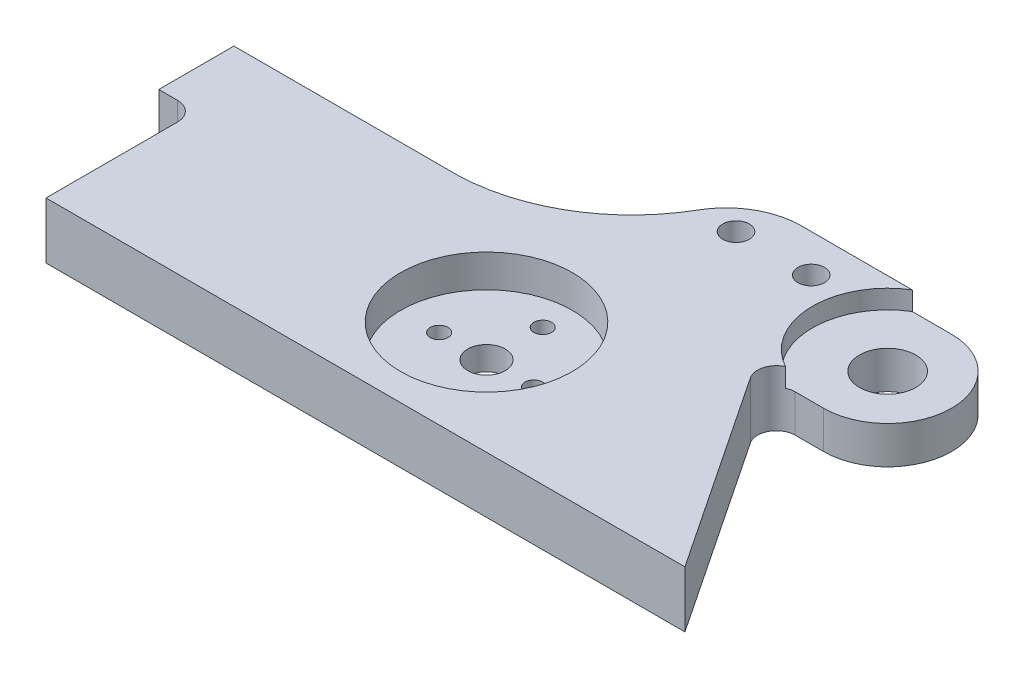
ISO-10303-21;
HEADER;
FILE_DESCRIPTION(('STEP AP214'),'2;1');
FILE_NAME('part.step','',(''),(''),'','','');
FILE_SCHEMA(('AUTOMOTIVE_DESIGN { 1 0 10303 214 1 1 1 1 }'));
ENDSEC;
DATA;
#1=APPLICATION_CONTEXT('core data for automotive mechanical design processes');
#2=APPLICATION_PROTOCOL_DEFINITION('international standard','automotive_design',2000,#1);
#3=PRODUCT_CONTEXT('',#1,'mechanical');
#4=PRODUCT('Part','Part','',(#3));
#5=PRODUCT_RELATED_PRODUCT_CATEGORY('part','',(#4));
#6=PRODUCT_DEFINITION_FORMATION('','',#4);
#7=PRODUCT_DEFINITION_CONTEXT('part definition',#1,'design');
#8=PRODUCT_DEFINITION('design','',#6,#7);
#9=PRODUCT_DEFINITION_SHAPE('','',#8);
#10=(LENGTH_UNIT() NAMED_UNIT(*) SI_UNIT(.MILLI.,.METRE.));
#11=(NAMED_UNIT(*) PLANE_ANGLE_UNIT() SI_UNIT($,.RADIAN.));
#12=(NAMED_UNIT(*) SI_UNIT($,.STERADIAN.) SOLID_ANGLE_UNIT());
#13=UNCERTAINTY_MEASURE_WITH_UNIT(LENGTH_MEASURE(1.E-05),#10,'distance_accuracy_value','');
#14=(GEOMETRIC_REPRESENTATION_CONTEXT(3) GLOBAL_UNCERTAINTY_ASSIGNED_CONTEXT((#13)) GLOBAL_UNIT_ASSIGNED_CONTEXT((#10,
#11,#12)) REPRESENTATION_CONTEXT('',''));
#15=CARTESIAN_POINT('',(0.,0.,0.));
#16=DIRECTION('',(0.,0.,1.));
#17=DIRECTION('',(1.,0.,0.));
#18=AXIS2_PLACEMENT_3D('',#15,#16,#17);
#19=CARTESIAN_POINT('',(99.6289220182295,9.525,0.));
#20=DIRECTION('',(0.,0.,-1.));
#21=DIRECTION('',(-1.,0.,0.));
#22=AXIS2_PLACEMENT_3D('',#19,#20,#21);
#23=PLANE('',#22);
#24=DIRECTION('',(1.,0.,0.));
#25=VECTOR('',#24,1.);
#26=CARTESIAN_POINT('',(99.6289220182295,6.35,0.));
#27=LINE('',#26,#25);
#28=CARTESIAN_POINT('',(94.8325417665327,6.35,0.));
#29=VERTEX_POINT('',#28);
#30=CARTESIAN_POINT('',(99.6289220182295,6.35,0.));
#31=VERTEX_POINT('',#30);
#32=EDGE_CURVE('E294',#29,#31,#27,.T.);
#33=ORIENTED_EDGE('',*,*,#32,.F.);
#34=DIRECTION('',(0.,-1.,0.));
#35=VECTOR('',#34,1.);
#36=CARTESIAN_POINT('',(94.8325417665327,0.,0.));
#37=LINE('',#36,#35);
#38=CARTESIAN_POINT('',(94.8325417665327,0.,0.));
#39=VERTEX_POINT('',#38);
#40=EDGE_CURVE('E262',#29,#39,#37,.T.);
#41=ORIENTED_EDGE('',*,*,#40,.T.);
#42=DIRECTION('',(1.,0.,0.));
#43=VECTOR('',#42,1.);
#44=CARTESIAN_POINT('',(99.6289220182295,0.,0.));
#45=LINE('',#44,#43);
#46=CARTESIAN_POINT('',(99.6289220182295,0.,0.));
#47=VERTEX_POINT('',#46);
#48=EDGE_CURVE('E210',#39,#47,#45,.T.);
#49=ORIENTED_EDGE('',*,*,#48,.T.);
#50=DIRECTION('',(0.,-1.,0.));
#51=VECTOR('',#50,1.);
#52=CARTESIAN_POINT('',(99.6289220182295,9.525,0.));
#53=LINE('',#52,#51);
#54=EDGE_CURVE('E247',#31,#47,#53,.T.);
#55=ORIENTED_EDGE('',*,*,#54,.F.);
#56=EDGE_LOOP('',(#33,#41,#49,#55));
#57=FACE_BOUND('',#56,.T.);
#58=ADVANCED_FACE('F40',(#57),#23,.F.);
#59=CARTESIAN_POINT('',(99.6289220182295,9.525,-10.8159932240115));
#60=DIRECTION('',(0.,-1.,0.));
#61=DIRECTION('',(0.,0.,-1.));
#62=AXIS2_PLACEMENT_3D('',#59,#60,#61);
#63=CYLINDRICAL_SURFACE('',#62,10.8159932240115);
#64=CARTESIAN_POINT('',(99.6289220182295,6.35,-10.8159932240115));
#65=DIRECTION('',(0.,1.,0.));
#66=DIRECTION('',(0.,0.,1.));
#67=AXIS2_PLACEMENT_3D('',#64,#65,#66);
#68=CIRCLE('',#67,10.8159932240115);
#69=CARTESIAN_POINT('',(99.6289220182295,6.35,-21.6319864480231));
#70=VERTEX_POINT('',#69);
#71=EDGE_CURVE('E302',#31,#70,#68,.T.);
#72=ORIENTED_EDGE('',*,*,#71,.F.);
#73=ORIENTED_EDGE('',*,*,#54,.T.);
#74=CARTESIAN_POINT('',(99.6289220182295,0.,-10.8159932240115));
#75=DIRECTION('',(0.,1.,0.));
#76=DIRECTION('',(0.,0.,-1.));
#77=AXIS2_PLACEMENT_3D('',#74,#75,#76);
#78=CIRCLE('',#77,10.8159932240115);
#79=CARTESIAN_POINT('',(99.6289220182295,0.,-21.6319864480231));
#80=VERTEX_POINT('',#79);
#81=EDGE_CURVE('E214',#47,#80,#78,.T.);
#82=ORIENTED_EDGE('',*,*,#81,.T.);
#83=DIRECTION('',(0.,-1.,0.));
#84=VECTOR('',#83,1.);
#85=CARTESIAN_POINT('',(99.6289220182295,9.525,-21.6319864480231));
#86=LINE('',#85,#84);
#87=EDGE_CURVE('E244',#70,#80,#86,.T.);
#88=ORIENTED_EDGE('',*,*,#87,.F.);
#89=EDGE_LOOP('',(#72,#73,#82,#88));
#90=FACE_BOUND('',#89,.T.);
#91=ADVANCED_FACE('F317',(#90),#63,.T.);
#92=CARTESIAN_POINT('',(99.6289220182295,9.525,-10.8159932240115));
#93=DIRECTION('',(0.,-1.,0.));
#94=DIRECTION('',(0.,0.,-1.));
#95=AXIS2_PLACEMENT_3D('',#92,#93,#94);
#96=CYLINDRICAL_SURFACE('',#95,4.76250000000001);
#97=CARTESIAN_POINT('',(99.6289220182295,0.,-10.8159932240115));
#98=DIRECTION('',(0.,1.,0.));
#99=DIRECTION('',(0.,0.,1.));
#100=AXIS2_PLACEMENT_3D('',#97,#98,#99);
#101=CIRCLE('',#100,4.76250000000001);
#102=CARTESIAN_POINT('',(99.6289220182295,0.,-6.05349322401153));
#103=VERTEX_POINT('',#102);
#104=EDGE_CURVE('E197',#103,#103,#101,.T.);
#105=ORIENTED_EDGE('',*,*,#104,.F.);
#106=EDGE_LOOP('',(#105));
#107=FACE_BOUND('',#106,.T.);
#108=CARTESIAN_POINT('',(99.6289220182295,6.35,-10.8159932240115));
#109=DIRECTION('',(0.,1.,0.));
#110=DIRECTION('',(0.,0.,1.));
#111=AXIS2_PLACEMENT_3D('',#108,#109,#110);
#112=CIRCLE('',#111,4.76250000000001);
#113=CARTESIAN_POINT('',(99.6289220182295,6.35,-6.05349322401153));
#114=VERTEX_POINT('',#113);
#115=EDGE_CURVE('E157',#114,#114,#112,.T.);
#116=ORIENTED_EDGE('',*,*,#115,.T.);
#117=EDGE_LOOP('',(#116));
#118=FACE_BOUND('',#117,.T.);
#119=ADVANCED_FACE('F445',(#107,#118),#96,.F.);
#120=CARTESIAN_POINT('',(69.7204790438301,9.525,19.05));
#121=DIRECTION('',(0.,-1.,0.));
#122=DIRECTION('',(0.,0.,-1.));
#123=AXIS2_PLACEMENT_3D('',#120,#121,#122);
#124=CYLINDRICAL_SURFACE('',#123,1.5);
#125=CARTESIAN_POINT('',(69.7204790438301,0.,19.05));
#126=DIRECTION('',(0.,1.,0.));
#127=DIRECTION('',(0.,0.,1.));
#128=AXIS2_PLACEMENT_3D('',#125,#126,#127);
#129=CIRCLE('',#128,1.5);
#130=CARTESIAN_POINT('',(69.7204790438301,0.,20.55));
#131=VERTEX_POINT('',#130);
#132=EDGE_CURVE('E364',#131,#131,#129,.T.);
#133=ORIENTED_EDGE('',*,*,#132,.F.);
#134=EDGE_LOOP('',(#133));
#135=FACE_BOUND('',#134,.T.);
#136=CARTESIAN_POINT('',(69.7204790438301,4.,19.05));
#137=DIRECTION('',(0.,1.,0.));
#138=DIRECTION('',(0.,0.,1.));
#139=AXIS2_PLACEMENT_3D('',#136,#137,#138);
#140=CIRCLE('',#139,1.5);
#141=CARTESIAN_POINT('',(69.7204790438301,4.,20.55));
#142=VERTEX_POINT('',#141);
#143=EDGE_CURVE('E344',#142,#142,#140,.T.);
#144=ORIENTED_EDGE('',*,*,#143,.T.);
#145=EDGE_LOOP('',(#144));
#146=FACE_BOUND('',#145,.T.);
#147=ADVANCED_FACE('F475',(#135,#146),#124,.F.);
#148=CARTESIAN_POINT('',(61.7204790438301,9.525,28.55));
#149=DIRECTION('',(0.,-1.,0.));
#150=DIRECTION('',(0.,0.,-1.));
#151=AXIS2_PLACEMENT_3D('',#148,#149,#150);
#152=CYLINDRICAL_SURFACE('',#151,1.5);
#153=CARTESIAN_POINT('',(61.7204790438301,0.,28.55));
#154=DIRECTION('',(0.,1.,0.));
#155=DIRECTION('',(0.,0.,1.));
#156=AXIS2_PLACEMENT_3D('',#153,#154,#155);
#157=CIRCLE('',#156,1.5);
#158=CARTESIAN_POINT('',(61.7204790438301,0.,30.05));
#159=VERTEX_POINT('',#158);
#160=EDGE_CURVE('E360',#159,#159,#157,.T.);
#161=ORIENTED_EDGE('',*,*,#160,.F.);
#162=EDGE_LOOP('',(#161));
#163=FACE_BOUND('',#162,.T.);
#164=CARTESIAN_POINT('',(61.7204790438301,4.,28.55));
#165=DIRECTION('',(0.,1.,0.));
#166=DIRECTION('',(0.,0.,1.));
#167=AXIS2_PLACEMENT_3D('',#164,#165,#166);
#168=CIRCLE('',#167,1.5);
#169=CARTESIAN_POINT('',(61.7204790438301,4.,30.05));
#170=VERTEX_POINT('',#169);
#171=EDGE_CURVE('E340',#170,#170,#168,.T.);
#172=ORIENTED_EDGE('',*,*,#171,.T.);
#173=EDGE_LOOP('',(#172));
#174=FACE_BOUND('',#173,.T.);
#175=ADVANCED_FACE('F548',(#163,#174),#152,.F.);
#176=CARTESIAN_POINT('',(53.7204790438301,9.525,19.05));
#177=DIRECTION('',(0.,-1.,0.));
#178=DIRECTION('',(0.,0.,-1.));
#179=AXIS2_PLACEMENT_3D('',#176,#177,#178);
#180=CYLINDRICAL_SURFACE('',#179,1.5);
#181=CARTESIAN_POINT('',(53.7204790438301,0.,19.05));
#182=DIRECTION('',(0.,1.,0.));
#183=DIRECTION('',(0.,0.,1.));
#184=AXIS2_PLACEMENT_3D('',#181,#182,#183);
#185=CIRCLE('',#184,1.5);
#186=CARTESIAN_POINT('',(53.7204790438301,0.,20.55));
#187=VERTEX_POINT('',#186);
#188=EDGE_CURVE('E356',#187,#187,#185,.T.);
#189=ORIENTED_EDGE('',*,*,#188,.F.);
#190=EDGE_LOOP('',(#189));
#191=FACE_BOUND('',#190,.T.);
#192=CARTESIAN_POINT('',(53.7204790438301,4.,19.05));
#193=DIRECTION('',(0.,1.,0.));
#194=DIRECTION('',(0.,0.,1.));
#195=AXIS2_PLACEMENT_3D('',#192,#193,#194);
#196=CIRCLE('',#195,1.5);
#197=CARTESIAN_POINT('',(53.7204790438301,4.,20.55));
#198=VERTEX_POINT('',#197);
#199=EDGE_CURVE('E336',#198,#198,#196,.T.);
#200=ORIENTED_EDGE('',*,*,#199,.T.);
#201=EDGE_LOOP('',(#200));
#202=FACE_BOUND('',#201,.T.);
#203=ADVANCED_FACE('F558',(#191,#202),#180,.F.);
#204=CARTESIAN_POINT('',(61.7204790438301,9.525,9.55000000000001));
#205=DIRECTION('',(0.,-1.,0.));
#206=DIRECTION('',(0.,0.,-1.));
#207=AXIS2_PLACEMENT_3D('',#204,#205,#206);
#208=CYLINDRICAL_SURFACE('',#207,1.5);
#209=CARTESIAN_POINT('',(61.7204790438301,0.,9.55000000000001));
#210=DIRECTION('',(0.,1.,0.));
#211=DIRECTION('',(0.,0.,1.));
#212=AXIS2_PLACEMENT_3D('',#209,#210,#211);
#213=CIRCLE('',#212,1.5);
#214=CARTESIAN_POINT('',(61.7204790438301,0.,11.05));
#215=VERTEX_POINT('',#214);
#216=EDGE_CURVE('E352',#215,#215,#213,.T.);
#217=ORIENTED_EDGE('',*,*,#216,.F.);
#218=EDGE_LOOP('',(#217));
#219=FACE_BOUND('',#218,.T.);
#220=CARTESIAN_POINT('',(61.7204790438301,4.,9.55000000000001));
#221=DIRECTION('',(0.,1.,0.));
#222=DIRECTION('',(0.,0.,1.));
#223=AXIS2_PLACEMENT_3D('',#220,#221,#222);
#224=CIRCLE('',#223,1.5);
#225=CARTESIAN_POINT('',(61.7204790438301,4.,11.05));
#226=VERTEX_POINT('',#225);
#227=EDGE_CURVE('E288',#226,#226,#224,.T.);
#228=ORIENTED_EDGE('',*,*,#227,.T.);
#229=EDGE_LOOP('',(#228));
#230=FACE_BOUND('',#229,.T.);
#231=ADVANCED_FACE('F567',(#219,#230),#208,.F.);
#232=CARTESIAN_POINT('',(61.7204790438301,9.525,19.05));
#233=DIRECTION('',(0.,-1.,0.));
#234=DIRECTION('',(0.,0.,-1.));
#235=AXIS2_PLACEMENT_3D('',#232,#233,#234);
#236=CYLINDRICAL_SURFACE('',#235,3.175);
#237=CARTESIAN_POINT('',(61.7204790438301,0.,19.05));
#238=DIRECTION('',(0.,1.,0.));
#239=DIRECTION('',(0.,0.,1.));
#240=AXIS2_PLACEMENT_3D('',#237,#238,#239);
#241=CIRCLE('',#240,3.175);
#242=CARTESIAN_POINT('',(61.7204790438301,0.,22.225));
#243=VERTEX_POINT('',#242);
#244=EDGE_CURVE('E348',#243,#243,#241,.T.);
#245=ORIENTED_EDGE('',*,*,#244,.F.);
#246=EDGE_LOOP('',(#245));
#247=FACE_BOUND('',#246,.T.);
#248=CARTESIAN_POINT('',(61.7204790438301,4.,19.05));
#249=DIRECTION('',(0.,1.,0.));
#250=DIRECTION('',(0.,0.,1.));
#251=AXIS2_PLACEMENT_3D('',#248,#249,#250);
#252=CIRCLE('',#251,3.175);
#253=CARTESIAN_POINT('',(61.7204790438301,4.,22.225));
#254=VERTEX_POINT('',#253);
#255=EDGE_CURVE('E285',#254,#254,#252,.T.);
#256=ORIENTED_EDGE('',*,*,#255,.T.);
#257=EDGE_LOOP('',(#256));
#258=FACE_BOUND('',#257,.T.);
#259=ADVANCED_FACE('F483',(#247,#258),#236,.F.);
#260=CARTESIAN_POINT('',(36.7936206027921,9.525,-30.4519912792341));
#261=DIRECTION('',(0.,-1.,0.));
#262=DIRECTION('',(0.,0.,-1.));
#263=AXIS2_PLACEMENT_3D('',#260,#261,#262);
#264=PLANE('',#263);
#265=CARTESIAN_POINT('',(61.7204790438301,9.525,19.05));
#266=DIRECTION('',(0.,1.,0.));
#267=DIRECTION('',(0.,0.,1.));
#268=AXIS2_PLACEMENT_3D('',#265,#266,#267);
#269=CIRCLE('',#268,14.5);
#270=CARTESIAN_POINT('',(61.7204790438301,9.525,33.55));
#271=VERTEX_POINT('',#270);
#272=EDGE_CURVE('E156',#271,#271,#269,.T.);
#273=ORIENTED_EDGE('',*,*,#272,.F.);
#274=EDGE_LOOP('',(#273));
#275=FACE_BOUND('',#274,.T.);
#276=CARTESIAN_POINT('',(94.8325417665327,9.525,3.175));
#277=DIRECTION('',(0.,-1.,0.));
#278=DIRECTION('',(0.,0.,-1.));
#279=AXIS2_PLACEMENT_3D('',#276,#277,#278);
#280=CIRCLE('',#279,3.175);
#281=CARTESIAN_POINT('',(92.1907820820101,9.525,4.9361731230151));
#282=VERTEX_POINT('',#281);
#283=CARTESIAN_POINT('',(93.486164763583,9.525,0.299605424306388));
#284=VERTEX_POINT('',#283);
#285=EDGE_CURVE('E167',#282,#284,#280,.T.);
#286=ORIENTED_EDGE('',*,*,#285,.T.);
#287=CARTESIAN_POINT('',(99.6289220182295,9.525,-10.8159932240115));
#288=DIRECTION('',(0.,1.,0.));
#289=DIRECTION('',(0.,0.,1.));
#290=AXIS2_PLACEMENT_3D('',#287,#288,#289);
#291=CIRCLE('',#290,12.7);
#292=CARTESIAN_POINT('',(92.9727751915635,9.525,-21.6319864480231));
#293=VERTEX_POINT('',#292);
#294=EDGE_CURVE('E151',#293,#284,#291,.T.);
#295=ORIENTED_EDGE('',*,*,#294,.F.);
#296=DIRECTION('',(-1.,0.,0.));
#297=VECTOR('',#296,1.);
#298=CARTESIAN_POINT('',(99.6289220182295,9.525,-21.6319864480231));
#299=LINE('',#298,#297);
#300=CARTESIAN_POINT('',(74.2289220182296,9.525,-21.6319864480231));
#301=VERTEX_POINT('',#300);
#302=EDGE_CURVE('E163',#293,#301,#299,.T.);
#303=ORIENTED_EDGE('',*,*,#302,.T.);
#304=CARTESIAN_POINT('',(74.2289220182296,9.525,-8.93198644802308));
#305=DIRECTION('',(0.,1.,0.));
#306=DIRECTION('',(0.,0.,1.));
#307=AXIS2_PLACEMENT_3D('',#304,#305,#306);
#308=CIRCLE('',#307,12.7);
#309=CARTESIAN_POINT('',(63.2185392489832,9.525,-15.2613996336734));
#310=VERTEX_POINT('',#309);
#311=EDGE_CURVE('E175',#301,#310,#308,.T.);
#312=ORIENTED_EDGE('',*,*,#311,.T.);
#313=CARTESIAN_POINT('',(36.7936206027921,9.525,-30.4519912792341));
#314=DIRECTION('',(0.,-1.,0.));
#315=DIRECTION('',(0.,0.,-1.));
#316=AXIS2_PLACEMENT_3D('',#313,#314,#315);
#317=CIRCLE('',#316,30.48);
#318=CARTESIAN_POINT('',(38.1,9.525,0.));
#319=VERTEX_POINT('',#318);
#320=EDGE_CURVE('E180',#310,#319,#317,.T.);
#321=ORIENTED_EDGE('',*,*,#320,.T.);
#322=DIRECTION('',(-1.,0.,0.));
#323=VECTOR('',#322,1.);
#324=CARTESIAN_POINT('',(0.,9.525,0.));
#325=LINE('',#324,#323);
#326=CARTESIAN_POINT('',(0.,9.525,0.));
#327=VERTEX_POINT('',#326);
#328=EDGE_CURVE('E188',#319,#327,#325,.T.);
#329=ORIENTED_EDGE('',*,*,#328,.T.);
#330=DIRECTION('',(0.,0.,1.));
#331=VECTOR('',#330,1.);
#332=CARTESIAN_POINT('',(0.,9.525,12.7));
#333=LINE('',#332,#331);
#334=CARTESIAN_POINT('',(0.,9.525,12.7));
#335=VERTEX_POINT('',#334);
#336=EDGE_CURVE('E230',#327,#335,#333,.T.);
#337=ORIENTED_EDGE('',*,*,#336,.T.);
#338=DIRECTION('',(1.,0.,0.));
#339=VECTOR('',#338,1.);
#340=CARTESIAN_POINT('',(6.35,9.525,12.7));
#341=LINE('',#340,#339);
#342=CARTESIAN_POINT('',(3.175,9.525,12.7));
#343=VERTEX_POINT('',#342);
#344=EDGE_CURVE('E390',#335,#343,#341,.T.);
#345=ORIENTED_EDGE('',*,*,#344,.T.);
#346=CARTESIAN_POINT('',(3.175,9.525,15.875));
#347=DIRECTION('',(0.,-1.,0.));
#348=DIRECTION('',(0.,0.,-1.));
#349=AXIS2_PLACEMENT_3D('',#346,#347,#348);
#350=CIRCLE('',#349,3.175);
#351=CARTESIAN_POINT('',(6.35,9.525,15.875));
#352=VERTEX_POINT('',#351);
#353=EDGE_CURVE('E282',#343,#352,#350,.T.);
#354=ORIENTED_EDGE('',*,*,#353,.T.);
#355=DIRECTION('',(0.,0.,1.));
#356=VECTOR('',#355,1.);
#357=CARTESIAN_POINT('',(6.35,9.525,38.1));
#358=LINE('',#357,#356);
#359=CARTESIAN_POINT('',(6.35,9.525,38.1));
#360=VERTEX_POINT('',#359);
#361=EDGE_CURVE('E393',#352,#360,#358,.T.);
#362=ORIENTED_EDGE('',*,*,#361,.T.);
#363=DIRECTION('',(1.,0.,0.));
#364=VECTOR('',#363,1.);
#365=CARTESIAN_POINT('',(114.3,9.525,38.1));
#366=LINE('',#365,#364);
#367=CARTESIAN_POINT('',(114.3,9.525,38.1));
#368=VERTEX_POINT('',#367);
#369=EDGE_CURVE('E182',#360,#368,#366,.T.);
#370=ORIENTED_EDGE('',*,*,#369,.T.);
#371=DIRECTION('',(-0.554700196225229,0.,-0.832050294337844));
#372=VECTOR('',#371,1.);
#373=CARTESIAN_POINT('',(88.9,9.525,0.));
#374=LINE('',#373,#372);
#375=EDGE_CURVE('E176',#368,#282,#374,.T.);
#376=ORIENTED_EDGE('',*,*,#375,.T.);
#377=EDGE_LOOP('',(#286,#295,#303,#312,#321,#329,#337,#345,#354,#362,#370,#376));
#378=FACE_BOUND('',#377,.T.);
#379=CARTESIAN_POINT('',(69.5685392489832,9.525,-15.2613996336734));
#380=DIRECTION('',(0.,1.,0.));
#381=DIRECTION('',(0.,0.,1.));
#382=AXIS2_PLACEMENT_3D('',#379,#380,#381);
#383=CIRCLE('',#382,2.2479);
#384=CARTESIAN_POINT('',(69.5685392489832,9.525,-13.0134996336734));
#385=VERTEX_POINT('',#384);
#386=EDGE_CURVE('E377',#385,#385,#383,.T.);
#387=ORIENTED_EDGE('',*,*,#386,.F.);
#388=EDGE_LOOP('',(#387));
#389=FACE_BOUND('',#388,.T.);
#390=CARTESIAN_POINT('',(82.2685392489832,9.525,-15.2613996336734));
#391=DIRECTION('',(0.,1.,0.));
#392=DIRECTION('',(0.,0.,1.));
#393=AXIS2_PLACEMENT_3D('',#390,#391,#392);
#394=CIRCLE('',#393,2.2479);
#395=CARTESIAN_POINT('',(82.2685392489832,9.525,-13.0134996336734));
#396=VERTEX_POINT('',#395);
#397=EDGE_CURVE('E369',#396,#396,#394,.T.);
#398=ORIENTED_EDGE('',*,*,#397,.F.);
#399=EDGE_LOOP('',(#398));
#400=FACE_BOUND('',#399,.T.);
#401=ADVANCED_FACE('F161',(#275,#378,#389,#400),#264,.F.);
#402=CARTESIAN_POINT('',(36.7936206027921,0.,-30.4519912792341));
#403=DIRECTION('',(0.,-1.,0.));
#404=DIRECTION('',(0.,0.,-1.));
#405=AXIS2_PLACEMENT_3D('',#402,#403,#404);
#406=PLANE('',#405);
#407=ORIENTED_EDGE('',*,*,#216,.T.);
#408=EDGE_LOOP('',(#407));
#409=FACE_BOUND('',#408,.T.);
#410=ORIENTED_EDGE('',*,*,#160,.T.);
#411=EDGE_LOOP('',(#410));
#412=FACE_BOUND('',#411,.T.);
#413=CARTESIAN_POINT('',(82.2685392489832,0.,-15.2613996336734));
#414=DIRECTION('',(0.,1.,0.));
#415=DIRECTION('',(0.,0.,1.));
#416=AXIS2_PLACEMENT_3D('',#413,#414,#415);
#417=CIRCLE('',#416,2.2479);
#418=CARTESIAN_POINT('',(82.2685392489832,0.,-13.0134996336734));
#419=VERTEX_POINT('',#418);
#420=EDGE_CURVE('E368',#419,#419,#417,.T.);
#421=ORIENTED_EDGE('',*,*,#420,.T.);
#422=EDGE_LOOP('',(#421));
#423=FACE_BOUND('',#422,.T.);
#424=ORIENTED_EDGE('',*,*,#104,.T.);
#425=EDGE_LOOP('',(#424));
#426=FACE_BOUND('',#425,.T.);
#427=DIRECTION('',(0.,0.,1.));
#428=VECTOR('',#427,1.);
#429=CARTESIAN_POINT('',(0.,0.,12.7));
#430=LINE('',#429,#428);
#431=CARTESIAN_POINT('',(0.,0.,0.));
#432=VERTEX_POINT('',#431);
#433=CARTESIAN_POINT('',(0.,0.,12.7));
#434=VERTEX_POINT('',#433);
#435=EDGE_CURVE('E192',#432,#434,#430,.T.);
#436=ORIENTED_EDGE('',*,*,#435,.F.);
#437=DIRECTION('',(-1.,0.,0.));
#438=VECTOR('',#437,1.);
#439=CARTESIAN_POINT('',(0.,0.,0.));
#440=LINE('',#439,#438);
#441=CARTESIAN_POINT('',(38.1,0.,0.));
#442=VERTEX_POINT('',#441);
#443=EDGE_CURVE('E227',#442,#432,#440,.T.);
#444=ORIENTED_EDGE('',*,*,#443,.F.);
#445=CARTESIAN_POINT('',(36.7936206027921,0.,-30.4519912792341));
#446=DIRECTION('',(0.,-1.,0.));
#447=DIRECTION('',(0.,0.,-1.));
#448=AXIS2_PLACEMENT_3D('',#445,#446,#447);
#449=CIRCLE('',#448,30.48);
#450=CARTESIAN_POINT('',(63.2185392489832,0.,-15.2613996336734));
#451=VERTEX_POINT('',#450);
#452=EDGE_CURVE('E224',#451,#442,#449,.T.);
#453=ORIENTED_EDGE('',*,*,#452,.F.);
#454=CARTESIAN_POINT('',(74.2289220182296,0.,-8.93198644802308));
#455=DIRECTION('',(0.,1.,0.));
#456=DIRECTION('',(0.,0.,1.));
#457=AXIS2_PLACEMENT_3D('',#454,#455,#456);
#458=CIRCLE('',#457,12.7);
#459=CARTESIAN_POINT('',(74.2289220182296,0.,-21.6319864480231));
#460=VERTEX_POINT('',#459);
#461=EDGE_CURVE('E221',#460,#451,#458,.T.);
#462=ORIENTED_EDGE('',*,*,#461,.F.);
#463=DIRECTION('',(-1.,0.,0.));
#464=VECTOR('',#463,1.);
#465=CARTESIAN_POINT('',(99.6289220182295,0.,-21.6319864480231));
#466=LINE('',#465,#464);
#467=EDGE_CURVE('E218',#80,#460,#466,.T.);
#468=ORIENTED_EDGE('',*,*,#467,.F.);
#469=ORIENTED_EDGE('',*,*,#81,.F.);
#470=ORIENTED_EDGE('',*,*,#48,.F.);
#471=CARTESIAN_POINT('',(94.8325417665327,0.,3.175));
#472=DIRECTION('',(0.,-1.,0.));
#473=DIRECTION('',(0.,0.,-1.));
#474=AXIS2_PLACEMENT_3D('',#471,#472,#473);
#475=CIRCLE('',#474,3.175);
#476=CARTESIAN_POINT('',(92.1907820820101,0.,4.9361731230151));
#477=VERTEX_POINT('',#476);
#478=EDGE_CURVE('E268',#39,#477,#475,.F.);
#479=ORIENTED_EDGE('',*,*,#478,.T.);
#480=DIRECTION('',(-0.554700196225229,0.,-0.832050294337844));
#481=VECTOR('',#480,1.);
#482=CARTESIAN_POINT('',(88.9,0.,0.));
#483=LINE('',#482,#481);
#484=CARTESIAN_POINT('',(114.3,0.,38.1));
#485=VERTEX_POINT('',#484);
#486=EDGE_CURVE('E206',#485,#477,#483,.T.);
#487=ORIENTED_EDGE('',*,*,#486,.F.);
#488=DIRECTION('',(1.,0.,0.));
#489=VECTOR('',#488,1.);
#490=CARTESIAN_POINT('',(114.3,0.,38.1));
#491=LINE('',#490,#489);
#492=CARTESIAN_POINT('',(6.35,0.,38.1));
#493=VERTEX_POINT('',#492);
#494=EDGE_CURVE('E203',#493,#485,#491,.T.);
#495=ORIENTED_EDGE('',*,*,#494,.F.);
#496=DIRECTION('',(0.,0.,1.));
#497=VECTOR('',#496,1.);
#498=CARTESIAN_POINT('',(6.35,0.,38.1));
#499=LINE('',#498,#497);
#500=CARTESIAN_POINT('',(6.35,0.,15.875));
#501=VERTEX_POINT('',#500);
#502=EDGE_CURVE('E200',#501,#493,#499,.T.);
#503=ORIENTED_EDGE('',*,*,#502,.F.);
#504=CARTESIAN_POINT('',(3.175,0.,15.875));
#505=DIRECTION('',(0.,-1.,0.));
#506=DIRECTION('',(0.,0.,-1.));
#507=AXIS2_PLACEMENT_3D('',#504,#505,#506);
#508=CIRCLE('',#507,3.175);
#509=CARTESIAN_POINT('',(3.175,0.,12.7));
#510=VERTEX_POINT('',#509);
#511=EDGE_CURVE('E279',#501,#510,#508,.F.);
#512=ORIENTED_EDGE('',*,*,#511,.T.);
#513=DIRECTION('',(1.,0.,0.));
#514=VECTOR('',#513,1.);
#515=CARTESIAN_POINT('',(6.35,0.,12.7));
#516=LINE('',#515,#514);
#517=EDGE_CURVE('E196',#434,#510,#516,.T.);
#518=ORIENTED_EDGE('',*,*,#517,.F.);
#519=EDGE_LOOP('',(#436,#444,#453,#462,#468,#469,#470,#479,#487,#495,#503,#512,#518));
#520=FACE_BOUND('',#519,.T.);
#521=CARTESIAN_POINT('',(69.5685392489832,0.,-15.2613996336734));
#522=DIRECTION('',(0.,1.,0.));
#523=DIRECTION('',(0.,0.,1.));
#524=AXIS2_PLACEMENT_3D('',#521,#522,#523);
#525=CIRCLE('',#524,2.2479);
#526=CARTESIAN_POINT('',(69.5685392489832,0.,-13.0134996336734));
#527=VERTEX_POINT('',#526);
#528=EDGE_CURVE('E373',#527,#527,#525,.T.);
#529=ORIENTED_EDGE('',*,*,#528,.T.);
#530=EDGE_LOOP('',(#529));
#531=FACE_BOUND('',#530,.T.);
#532=ORIENTED_EDGE('',*,*,#132,.T.);
#533=EDGE_LOOP('',(#532));
#534=FACE_BOUND('',#533,.T.);
#535=ORIENTED_EDGE('',*,*,#188,.T.);
#536=EDGE_LOOP('',(#535));
#537=FACE_BOUND('',#536,.T.);
#538=ORIENTED_EDGE('',*,*,#244,.T.);
#539=EDGE_LOOP('',(#538));
#540=FACE_BOUND('',#539,.T.);
#541=ADVANCED_FACE('F311',(#409,#412,#423,#426,#520,#531,#534,#537,#540),#406,.T.);
#542=CARTESIAN_POINT('',(0.,9.525,12.7));
#543=DIRECTION('',(1.,0.,0.));
#544=DIRECTION('',(0.,0.,-1.));
#545=AXIS2_PLACEMENT_3D('',#542,#543,#544);
#546=PLANE('',#545);
#547=ORIENTED_EDGE('',*,*,#435,.T.);
#548=DIRECTION('',(0.,-1.,0.));
#549=VECTOR('',#548,1.);
#550=CARTESIAN_POINT('',(0.,9.525,12.7));
#551=LINE('',#550,#549);
#552=EDGE_CURVE('E258',#335,#434,#551,.T.);
#553=ORIENTED_EDGE('',*,*,#552,.F.);
#554=ORIENTED_EDGE('',*,*,#336,.F.);
#555=DIRECTION('',(0.,-1.,0.));
#556=VECTOR('',#555,1.);
#557=CARTESIAN_POINT('',(0.,9.525,0.));
#558=LINE('',#557,#556);
#559=EDGE_CURVE('E191',#327,#432,#558,.T.);
#560=ORIENTED_EDGE('',*,*,#559,.T.);
#561=EDGE_LOOP('',(#547,#553,#554,#560));
#562=FACE_BOUND('',#561,.T.);
#563=ADVANCED_FACE('F416',(#562),#546,.F.);
#564=CARTESIAN_POINT('',(6.35,9.525,12.7));
#565=DIRECTION('',(0.,0.,-1.));
#566=DIRECTION('',(-1.,0.,0.));
#567=AXIS2_PLACEMENT_3D('',#564,#565,#566);
#568=PLANE('',#567);
#569=ORIENTED_EDGE('',*,*,#517,.T.);
#570=DIRECTION('',(0.,-1.,0.));
#571=VECTOR('',#570,1.);
#572=CARTESIAN_POINT('',(3.175,9.525,12.7));
#573=LINE('',#572,#571);
#574=EDGE_CURVE('E64',#510,#343,#573,.F.);
#575=ORIENTED_EDGE('',*,*,#574,.T.);
#576=ORIENTED_EDGE('',*,*,#344,.F.);
#577=ORIENTED_EDGE('',*,*,#552,.T.);
#578=EDGE_LOOP('',(#569,#575,#576,#577));
#579=FACE_BOUND('',#578,.T.);
#580=ADVANCED_FACE('F414',(#579),#568,.F.);
#581=CARTESIAN_POINT('',(6.35,9.525,38.1));
#582=DIRECTION('',(1.,0.,0.));
#583=DIRECTION('',(0.,0.,-1.));
#584=AXIS2_PLACEMENT_3D('',#581,#582,#583);
#585=PLANE('',#584);
#586=ORIENTED_EDGE('',*,*,#361,.F.);
#587=DIRECTION('',(0.,-1.,0.));
#588=VECTOR('',#587,1.);
#589=CARTESIAN_POINT('',(6.35,0.,15.875));
#590=LINE('',#589,#588);
#591=EDGE_CURVE('E273',#352,#501,#590,.T.);
#592=ORIENTED_EDGE('',*,*,#591,.T.);
#593=ORIENTED_EDGE('',*,*,#502,.T.);
#594=DIRECTION('',(0.,-1.,0.));
#595=VECTOR('',#594,1.);
#596=CARTESIAN_POINT('',(6.35,9.525,38.1));
#597=LINE('',#596,#595);
#598=EDGE_CURVE('E254',#360,#493,#597,.T.);
#599=ORIENTED_EDGE('',*,*,#598,.F.);
#600=EDGE_LOOP('',(#586,#592,#593,#599));
#601=FACE_BOUND('',#600,.T.);
#602=ADVANCED_FACE('F408',(#601),#585,.F.);
#603=CARTESIAN_POINT('',(114.3,9.525,38.1));
#604=DIRECTION('',(0.,0.,-1.));
#605=DIRECTION('',(-1.,0.,0.));
#606=AXIS2_PLACEMENT_3D('',#603,#604,#605);
#607=PLANE('',#606);
#608=ORIENTED_EDGE('',*,*,#494,.T.);
#609=DIRECTION('',(0.,-1.,0.));
#610=VECTOR('',#609,1.);
#611=CARTESIAN_POINT('',(114.3,9.525,38.1));
#612=LINE('',#611,#610);
#613=EDGE_CURVE('E250',#368,#485,#612,.T.);
#614=ORIENTED_EDGE('',*,*,#613,.F.);
#615=ORIENTED_EDGE('',*,*,#369,.F.);
#616=ORIENTED_EDGE('',*,*,#598,.T.);
#617=EDGE_LOOP('',(#608,#614,#615,#616));
#618=FACE_BOUND('',#617,.T.);
#619=ADVANCED_FACE('F402',(#618),#607,.F.);
#620=CARTESIAN_POINT('',(88.9,9.525,0.));
#621=DIRECTION('',(-0.832050294337844,0.,0.554700196225229));
#622=DIRECTION('',(0.554700196225229,0.,0.832050294337844));
#623=AXIS2_PLACEMENT_3D('',#620,#621,#622);
#624=PLANE('',#623);
#625=ORIENTED_EDGE('',*,*,#486,.T.);
#626=DIRECTION('',(0.,-1.,0.));
#627=VECTOR('',#626,1.);
#628=CARTESIAN_POINT('',(92.1907820820101,9.525,4.9361731230151));
#629=LINE('',#628,#627);
#630=EDGE_CURVE('E265',#477,#282,#629,.F.);
#631=ORIENTED_EDGE('',*,*,#630,.T.);
#632=ORIENTED_EDGE('',*,*,#375,.F.);
#633=ORIENTED_EDGE('',*,*,#613,.T.);
#634=EDGE_LOOP('',(#625,#631,#632,#633));
#635=FACE_BOUND('',#634,.T.);
#636=ADVANCED_FACE('F405',(#635),#624,.F.);
#637=CARTESIAN_POINT('',(99.6289220182295,9.525,-21.6319864480231));
#638=DIRECTION('',(0.,0.,1.));
#639=DIRECTION('',(1.,0.,0.));
#640=AXIS2_PLACEMENT_3D('',#637,#638,#639);
#641=PLANE('',#640);
#642=ORIENTED_EDGE('',*,*,#302,.F.);
#643=DIRECTION('',(0.,1.,0.));
#644=VECTOR('',#643,1.);
#645=CARTESIAN_POINT('',(92.9727751915635,6.35,-21.6319864480231));
#646=LINE('',#645,#644);
#647=CARTESIAN_POINT('',(92.9727751915635,6.35,-21.6319864480231));
#648=VERTEX_POINT('',#647);
#649=EDGE_CURVE('E148',#293,#648,#646,.F.);
#650=ORIENTED_EDGE('',*,*,#649,.T.);
#651=DIRECTION('',(-1.,0.,0.));
#652=VECTOR('',#651,1.);
#653=CARTESIAN_POINT('',(99.6289220182295,6.35,-21.6319864480231));
#654=LINE('',#653,#652);
#655=EDGE_CURVE('E319',#70,#648,#654,.T.);
#656=ORIENTED_EDGE('',*,*,#655,.F.);
#657=ORIENTED_EDGE('',*,*,#87,.T.);
#658=ORIENTED_EDGE('',*,*,#467,.T.);
#659=DIRECTION('',(0.,-1.,0.));
#660=VECTOR('',#659,1.);
#661=CARTESIAN_POINT('',(74.2289220182296,9.525,-21.6319864480231));
#662=LINE('',#661,#660);
#663=EDGE_CURVE('E172',#301,#460,#662,.T.);
#664=ORIENTED_EDGE('',*,*,#663,.F.);
#665=EDGE_LOOP('',(#642,#650,#656,#657,#658,#664));
#666=FACE_BOUND('',#665,.T.);
#667=ADVANCED_FACE('F170',(#666),#641,.F.);
#668=CARTESIAN_POINT('',(74.2289220182296,9.525,-8.93198644802308));
#669=DIRECTION('',(0.,-1.,0.));
#670=DIRECTION('',(0.,0.,-1.));
#671=AXIS2_PLACEMENT_3D('',#668,#669,#670);
#672=CYLINDRICAL_SURFACE('',#671,12.7);
#673=ORIENTED_EDGE('',*,*,#461,.T.);
#674=DIRECTION('',(0.,-1.,0.));
#675=VECTOR('',#674,1.);
#676=CARTESIAN_POINT('',(63.2185392489832,9.525,-15.2613996336734));
#677=LINE('',#676,#675);
#678=EDGE_CURVE('E238',#310,#451,#677,.T.);
#679=ORIENTED_EDGE('',*,*,#678,.F.);
#680=ORIENTED_EDGE('',*,*,#311,.F.);
#681=ORIENTED_EDGE('',*,*,#663,.T.);
#682=EDGE_LOOP('',(#673,#679,#680,#681));
#683=FACE_BOUND('',#682,.T.);
#684=ADVANCED_FACE('F429',(#683),#672,.T.);
#685=CARTESIAN_POINT('',(36.7936206027921,9.525,-30.4519912792341));
#686=DIRECTION('',(0.,-1.,0.));
#687=DIRECTION('',(0.,0.,-1.));
#688=AXIS2_PLACEMENT_3D('',#685,#686,#687);
#689=CYLINDRICAL_SURFACE('',#688,30.48);
#690=ORIENTED_EDGE('',*,*,#452,.T.);
#691=DIRECTION('',(0.,-1.,0.));
#692=VECTOR('',#691,1.);
#693=CARTESIAN_POINT('',(38.1,9.525,0.));
#694=LINE('',#693,#692);
#695=EDGE_CURVE('E234',#319,#442,#694,.T.);
#696=ORIENTED_EDGE('',*,*,#695,.F.);
#697=ORIENTED_EDGE('',*,*,#320,.F.);
#698=ORIENTED_EDGE('',*,*,#678,.T.);
#699=EDGE_LOOP('',(#690,#696,#697,#698));
#700=FACE_BOUND('',#699,.T.);
#701=ADVANCED_FACE('F426',(#700),#689,.F.);
#702=CARTESIAN_POINT('',(0.,9.525,0.));
#703=DIRECTION('',(0.,0.,1.));
#704=DIRECTION('',(1.,0.,0.));
#705=AXIS2_PLACEMENT_3D('',#702,#703,#704);
#706=PLANE('',#705);
#707=ORIENTED_EDGE('',*,*,#443,.T.);
#708=ORIENTED_EDGE('',*,*,#559,.F.);
#709=ORIENTED_EDGE('',*,*,#328,.F.);
#710=ORIENTED_EDGE('',*,*,#695,.T.);
#711=EDGE_LOOP('',(#707,#708,#709,#710));
#712=FACE_BOUND('',#711,.T.);
#713=ADVANCED_FACE('F421',(#712),#706,.F.);
#714=CARTESIAN_POINT('',(69.5685392489832,9.525,-15.2613996336734));
#715=DIRECTION('',(0.,-1.,0.));
#716=DIRECTION('',(0.,0.,-1.));
#717=AXIS2_PLACEMENT_3D('',#714,#715,#716);
#718=CYLINDRICAL_SURFACE('',#717,2.2479);
#719=ORIENTED_EDGE('',*,*,#386,.T.);
#720=EDGE_LOOP('',(#719));
#721=FACE_BOUND('',#720,.T.);
#722=ORIENTED_EDGE('',*,*,#528,.F.);
#723=EDGE_LOOP('',(#722));
#724=FACE_BOUND('',#723,.T.);
#725=ADVANCED_FACE('F465',(#721,#724),#718,.F.);
#726=CARTESIAN_POINT('',(82.2685392489832,9.525,-15.2613996336734));
#727=DIRECTION('',(0.,-1.,0.));
#728=DIRECTION('',(0.,0.,-1.));
#729=AXIS2_PLACEMENT_3D('',#726,#727,#728);
#730=CYLINDRICAL_SURFACE('',#729,2.2479);
#731=ORIENTED_EDGE('',*,*,#397,.T.);
#732=EDGE_LOOP('',(#731));
#733=FACE_BOUND('',#732,.T.);
#734=ORIENTED_EDGE('',*,*,#420,.F.);
#735=EDGE_LOOP('',(#734));
#736=FACE_BOUND('',#735,.T.);
#737=ADVANCED_FACE('F458',(#733,#736),#730,.F.);
#738=CARTESIAN_POINT('',(94.8325417665327,9.525,3.175));
#739=DIRECTION('',(0.,1.,0.));
#740=DIRECTION('',(0.,0.,1.));
#741=AXIS2_PLACEMENT_3D('',#738,#739,#740);
#742=CYLINDRICAL_SURFACE('',#741,3.175);
#743=CARTESIAN_POINT('',(94.8325417665327,6.35,3.175));
#744=DIRECTION('',(0.,1.,0.));
#745=DIRECTION('',(0.,0.,1.));
#746=AXIS2_PLACEMENT_3D('',#743,#744,#745);
#747=CIRCLE('',#746,3.175);
#748=CARTESIAN_POINT('',(93.486164763583,6.35,0.299605424306388));
#749=VERTEX_POINT('',#748);
#750=EDGE_CURVE('E49',#749,#29,#747,.F.);
#751=ORIENTED_EDGE('',*,*,#750,.F.);
#752=DIRECTION('',(0.,1.,0.));
#753=VECTOR('',#752,1.);
#754=CARTESIAN_POINT('',(93.486164763583,7.9375,0.299605424306395));
#755=LINE('',#754,#753);
#756=EDGE_CURVE('E11',#749,#284,#755,.T.);
#757=ORIENTED_EDGE('',*,*,#756,.T.);
#758=ORIENTED_EDGE('',*,*,#285,.F.);
#759=ORIENTED_EDGE('',*,*,#630,.F.);
#760=ORIENTED_EDGE('',*,*,#478,.F.);
#761=ORIENTED_EDGE('',*,*,#40,.F.);
#762=EDGE_LOOP('',(#751,#757,#758,#759,#760,#761));
#763=FACE_BOUND('',#762,.T.);
#764=ADVANCED_FACE('F304',(#763),#742,.F.);
#765=CARTESIAN_POINT('',(3.175,9.525,15.875));
#766=DIRECTION('',(0.,1.,0.));
#767=DIRECTION('',(0.,0.,1.));
#768=AXIS2_PLACEMENT_3D('',#765,#766,#767);
#769=CYLINDRICAL_SURFACE('',#768,3.175);
#770=ORIENTED_EDGE('',*,*,#353,.F.);
#771=ORIENTED_EDGE('',*,*,#574,.F.);
#772=ORIENTED_EDGE('',*,*,#511,.F.);
#773=ORIENTED_EDGE('',*,*,#591,.F.);
#774=EDGE_LOOP('',(#770,#771,#772,#773));
#775=FACE_BOUND('',#774,.T.);
#776=ADVANCED_FACE('F42',(#775),#769,.F.);
#777=CARTESIAN_POINT('',(61.7204790438301,4.,19.05));
#778=DIRECTION('',(0.,1.,0.));
#779=DIRECTION('',(0.,0.,1.));
#780=AXIS2_PLACEMENT_3D('',#777,#778,#779);
#781=CYLINDRICAL_SURFACE('',#780,14.5);
#782=CARTESIAN_POINT('',(61.7204790438301,4.,19.05));
#783=DIRECTION('',(0.,1.,0.));
#784=DIRECTION('',(0.,0.,1.));
#785=AXIS2_PLACEMENT_3D('',#782,#783,#784);
#786=CIRCLE('',#785,14.5);
#787=CARTESIAN_POINT('',(61.7204790438301,4.,33.55));
#788=VERTEX_POINT('',#787);
#789=EDGE_CURVE('E289',#788,#788,#786,.T.);
#790=ORIENTED_EDGE('',*,*,#789,.F.);
#791=EDGE_LOOP('',(#790));
#792=FACE_BOUND('',#791,.T.);
#793=ORIENTED_EDGE('',*,*,#272,.T.);
#794=EDGE_LOOP('',(#793));
#795=FACE_BOUND('',#794,.T.);
#796=ADVANCED_FACE('F463',(#792,#795),#781,.F.);
#797=CARTESIAN_POINT('',(61.7204790438301,4.,19.05));
#798=DIRECTION('',(0.,1.,0.));
#799=DIRECTION('',(0.,0.,1.));
#800=AXIS2_PLACEMENT_3D('',#797,#798,#799);
#801=PLANE('',#800);
#802=ORIENTED_EDGE('',*,*,#143,.F.);
#803=EDGE_LOOP('',(#802));
#804=FACE_BOUND('',#803,.T.);
#805=ORIENTED_EDGE('',*,*,#171,.F.);
#806=EDGE_LOOP('',(#805));
#807=FACE_BOUND('',#806,.T.);
#808=ORIENTED_EDGE('',*,*,#199,.F.);
#809=EDGE_LOOP('',(#808));
#810=FACE_BOUND('',#809,.T.);
#811=ORIENTED_EDGE('',*,*,#227,.F.);
#812=EDGE_LOOP('',(#811));
#813=FACE_BOUND('',#812,.T.);
#814=ORIENTED_EDGE('',*,*,#255,.F.);
#815=EDGE_LOOP('',(#814));
#816=FACE_BOUND('',#815,.T.);
#817=ORIENTED_EDGE('',*,*,#789,.T.);
#818=EDGE_LOOP('',(#817));
#819=FACE_BOUND('',#818,.T.);
#820=ADVANCED_FACE('F591',(#804,#807,#810,#813,#816,#819),#801,.T.);
#821=CARTESIAN_POINT('',(99.6289220182295,6.35,-10.8159932240115));
#822=DIRECTION('',(0.,1.,0.));
#823=DIRECTION('',(0.,0.,1.));
#824=AXIS2_PLACEMENT_3D('',#821,#822,#823);
#825=CYLINDRICAL_SURFACE('',#824,12.7);
#826=ORIENTED_EDGE('',*,*,#294,.T.);
#827=ORIENTED_EDGE('',*,*,#756,.F.);
#828=CARTESIAN_POINT('',(99.6289220182295,6.35,-10.8159932240115));
#829=DIRECTION('',(0.,1.,0.));
#830=DIRECTION('',(0.,0.,1.));
#831=AXIS2_PLACEMENT_3D('',#828,#829,#830);
#832=CIRCLE('',#831,12.7);
#833=EDGE_CURVE('E56',#648,#749,#832,.T.);
#834=ORIENTED_EDGE('',*,*,#833,.F.);
#835=ORIENTED_EDGE('',*,*,#649,.F.);
#836=EDGE_LOOP('',(#826,#827,#834,#835));
#837=FACE_BOUND('',#836,.T.);
#838=ADVANCED_FACE('F150',(#837),#825,.F.);
#839=CARTESIAN_POINT('',(99.6289220182295,6.35,-10.8159932240115));
#840=DIRECTION('',(0.,1.,0.));
#841=DIRECTION('',(0.,0.,1.));
#842=AXIS2_PLACEMENT_3D('',#839,#840,#841);
#843=PLANE('',#842);
#844=ORIENTED_EDGE('',*,*,#115,.F.);
#845=EDGE_LOOP('',(#844));
#846=FACE_BOUND('',#845,.T.);
#847=ORIENTED_EDGE('',*,*,#655,.T.);
#848=ORIENTED_EDGE('',*,*,#833,.T.);
#849=ORIENTED_EDGE('',*,*,#750,.T.);
#850=ORIENTED_EDGE('',*,*,#32,.T.);
#851=ORIENTED_EDGE('',*,*,#71,.T.);
#852=EDGE_LOOP('',(#847,#848,#849,#850,#851));
#853=FACE_BOUND('',#852,.T.);
#854=ADVANCED_FACE('F293',(#846,#853),#843,.T.);
#855=CLOSED_SHELL('',(#58,#91,#119,#147,#175,#203,#231,#259,#401,#541,#563,#580,#602,#619,#636,
#667,#684,#701,#713,#725,#737,#764,#776,#796,#820,#838,#854));
#856=MANIFOLD_SOLID_BREP('B2',#855);
#857=ADVANCED_BREP_SHAPE_REPRESENTATION('',(#18,#856),#14);
#858=SHAPE_DEFINITION_REPRESENTATION(#9,#857);
ENDSEC;
END-ISO-10303-21;
